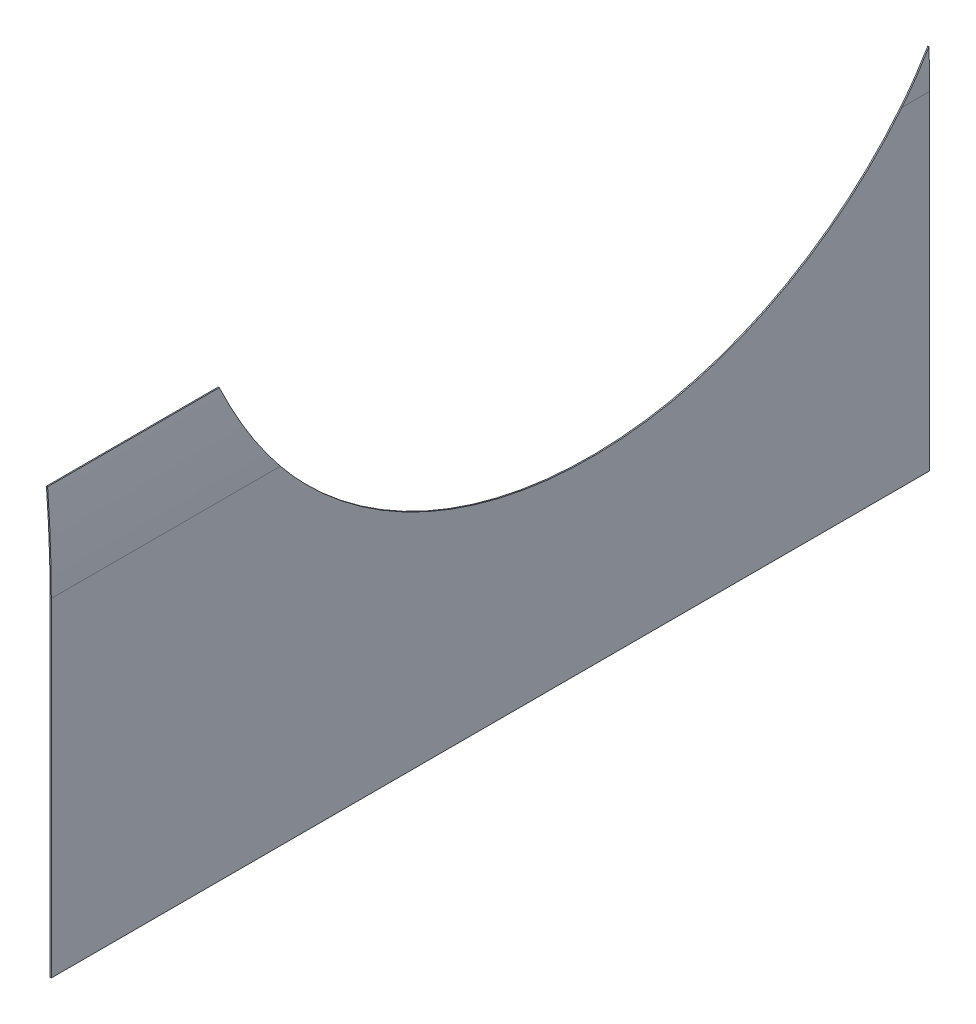
ISO-10303-21;
HEADER;
FILE_DESCRIPTION(('STEP AP214'),'2;1');
FILE_NAME('part.step','',(''),(''),'','','');
FILE_SCHEMA(('AUTOMOTIVE_DESIGN { 1 0 10303 214 1 1 1 1 }'));
ENDSEC;
DATA;
#1=APPLICATION_CONTEXT('core data for automotive mechanical design processes');
#2=APPLICATION_PROTOCOL_DEFINITION('international standard','automotive_design',2000,#1);
#3=PRODUCT_CONTEXT('',#1,'mechanical');
#4=PRODUCT('Part','Part','',(#3));
#5=PRODUCT_RELATED_PRODUCT_CATEGORY('part','',(#4));
#6=PRODUCT_DEFINITION_FORMATION('','',#4);
#7=PRODUCT_DEFINITION_CONTEXT('part definition',#1,'design');
#8=PRODUCT_DEFINITION('design','',#6,#7);
#9=PRODUCT_DEFINITION_SHAPE('','',#8);
#10=(LENGTH_UNIT() NAMED_UNIT(*) SI_UNIT(.MILLI.,.METRE.));
#11=(NAMED_UNIT(*) PLANE_ANGLE_UNIT() SI_UNIT($,.RADIAN.));
#12=(NAMED_UNIT(*) SI_UNIT($,.STERADIAN.) SOLID_ANGLE_UNIT());
#13=UNCERTAINTY_MEASURE_WITH_UNIT(LENGTH_MEASURE(1.E-05),#10,'distance_accuracy_value','');
#14=(GEOMETRIC_REPRESENTATION_CONTEXT(3) GLOBAL_UNCERTAINTY_ASSIGNED_CONTEXT((#13)) GLOBAL_UNIT_ASSIGNED_CONTEXT((#10,
#11,#12)) REPRESENTATION_CONTEXT('',''));
#15=CARTESIAN_POINT('',(0.,0.,0.));
#16=DIRECTION('',(0.,0.,1.));
#17=DIRECTION('',(1.,0.,0.));
#18=AXIS2_PLACEMENT_3D('',#15,#16,#17);
#19=CARTESIAN_POINT('',(-5.00000000000243,429.413496662776,1500.));
#20=DIRECTION('',(0.,0.,1.));
#21=DIRECTION('',(1.,0.,0.));
#22=AXIS2_PLACEMENT_3D('',#19,#20,#21);
#23=PLANE('',#22);
#24=CARTESIAN_POINT('',(-2100.,429.413496662785,1500.));
#25=DIRECTION('',(0.,0.,-1.));
#26=DIRECTION('',(1.,0.,0.));
#27=AXIS2_PLACEMENT_3D('',#24,#25,#26);
#28=CIRCLE('',#27,2095.);
#29=CARTESIAN_POINT('',(-11.2854840550565,591.57597962623,1500.));
#30=VERTEX_POINT('',#29);
#31=CARTESIAN_POINT('',(-5.00000000000243,429.413496662776,1500.));
#32=VERTEX_POINT('',#31);
#33=EDGE_CURVE('E99',#30,#32,#28,.T.);
#34=ORIENTED_EDGE('',*,*,#33,.F.);
#35=DIRECTION('',(0.996999768947468,0.0774045264741981,0.));
#36=VECTOR('',#35,1.);
#37=CARTESIAN_POINT('',(-11.2854840550565,591.57597962623,1500.));
#38=LINE('',#37,#36);
#39=CARTESIAN_POINT('',(-13.2794835929513,591.421170573282,1500.));
#40=VERTEX_POINT('',#39);
#41=EDGE_CURVE('E80',#30,#40,#38,.F.);
#42=ORIENTED_EDGE('',*,*,#41,.T.);
#43=CARTESIAN_POINT('',(-2100.,429.413496662785,1500.));
#44=DIRECTION('',(0.,0.,1.));
#45=DIRECTION('',(1.,0.,0.));
#46=AXIS2_PLACEMENT_3D('',#43,#44,#45);
#47=CIRCLE('',#46,2093.);
#48=CARTESIAN_POINT('',(-7.00000000000243,429.413496662776,1500.));
#49=VERTEX_POINT('',#48);
#50=EDGE_CURVE('E91',#40,#49,#47,.F.);
#51=ORIENTED_EDGE('',*,*,#50,.T.);
#52=DIRECTION('',(-1.,0.,0.));
#53=VECTOR('',#52,1.);
#54=CARTESIAN_POINT('',(-5.00000000000243,429.413496662776,1500.));
#55=LINE('',#54,#53);
#56=EDGE_CURVE('E106',#32,#49,#55,.T.);
#57=ORIENTED_EDGE('',*,*,#56,.F.);
#58=EDGE_LOOP('',(#34,#42,#51,#57));
#59=FACE_BOUND('',#58,.T.);
#60=ADVANCED_FACE('F37',(#59),#23,.T.);
#61=CARTESIAN_POINT('',(-19.1797937076434,672.749209383758,0.));
#62=DIRECTION('',(0.,0.,-1.));
#63=DIRECTION('',(-1.,0.,0.));
#64=AXIS2_PLACEMENT_3D('',#61,#62,#63);
#65=PLANE('',#64);
#66=CARTESIAN_POINT('',(-2100.,429.413496662785,0.));
#67=DIRECTION('',(0.,0.,1.));
#68=DIRECTION('',(1.,0.,0.));
#69=AXIS2_PLACEMENT_3D('',#66,#67,#68);
#70=CIRCLE('',#69,2093.);
#71=CARTESIAN_POINT('',(-8.02976236904085,495.060468156216,0.));
#72=VERTEX_POINT('',#71);
#73=CARTESIAN_POINT('',(-7.00000000000243,429.413496662776,0.));
#74=VERTEX_POINT('',#73);
#75=EDGE_CURVE('E218',#72,#74,#70,.F.);
#76=ORIENTED_EDGE('',*,*,#75,.F.);
#77=DIRECTION('',(0.999507996956981,0.0313650126581042,0.));
#78=VECTOR('',#77,1.);
#79=CARTESIAN_POINT('',(-8.02976236904129,495.060468156216,0.));
#80=LINE('',#79,#78);
#81=CARTESIAN_POINT('',(-6.03074637512721,495.123198181534,0.));
#82=VERTEX_POINT('',#81);
#83=EDGE_CURVE('E47',#82,#72,#80,.F.);
#84=ORIENTED_EDGE('',*,*,#83,.F.);
#85=CARTESIAN_POINT('',(-2100.,429.413496662785,0.));
#86=DIRECTION('',(0.,0.,-1.));
#87=DIRECTION('',(1.,0.,0.));
#88=AXIS2_PLACEMENT_3D('',#85,#86,#87);
#89=CIRCLE('',#88,2095.);
#90=CARTESIAN_POINT('',(-5.00000000000243,429.413496662776,0.));
#91=VERTEX_POINT('',#90);
#92=EDGE_CURVE('E206',#82,#91,#89,.T.);
#93=ORIENTED_EDGE('',*,*,#92,.T.);
#94=DIRECTION('',(1.,0.,0.));
#95=VECTOR('',#94,1.);
#96=CARTESIAN_POINT('',(-7.00000000000243,429.413496662776,0.));
#97=LINE('',#96,#95);
#98=EDGE_CURVE('E222',#74,#91,#97,.T.);
#99=ORIENTED_EDGE('',*,*,#98,.F.);
#100=EDGE_LOOP('',(#76,#84,#93,#99));
#101=FACE_BOUND('',#100,.T.);
#102=ADVANCED_FACE('F258',(#101),#65,.T.);
#103=CARTESIAN_POINT('',(-7.00000000000243,429.413496662776,1500.));
#104=DIRECTION('',(1.,0.,0.));
#105=DIRECTION('',(0.,1.,0.));
#106=AXIS2_PLACEMENT_3D('',#103,#104,#105);
#107=PLANE('',#106);
#108=CARTESIAN_POINT('',(-7.00000000000245,860.779048097804,578.000000000015));
#109=DIRECTION('',(-1.,0.,0.));
#110=DIRECTION('',(0.,3.69749714926331E-13,-1.));
#111=AXIS2_PLACEMENT_3D('',#108,#109,#110);
#112=ELLIPSE('',#111,684.,683.826642787176);
#113=CARTESIAN_POINT('',(-7.00000000000243,429.413496662776,47.2595695376983));
#114=VERTEX_POINT('',#113);
#115=CARTESIAN_POINT('',(-7.00000000000243,429.413496662776,1108.74043046233));
#116=VERTEX_POINT('',#115);
#117=EDGE_CURVE('E104',#114,#116,#112,.T.);
#118=ORIENTED_EDGE('',*,*,#117,.F.);
#119=DIRECTION('',(0.,0.,-1.));
#120=VECTOR('',#119,1.);
#121=CARTESIAN_POINT('',(-7.00000000000243,429.413496662776,1500.));
#122=LINE('',#121,#120);
#123=EDGE_CURVE('E203',#114,#74,#122,.T.);
#124=ORIENTED_EDGE('',*,*,#123,.T.);
#125=DIRECTION('',(0.,-1.,0.));
#126=VECTOR('',#125,1.);
#127=CARTESIAN_POINT('',(-7.00000000000243,429.413496662776,0.));
#128=LINE('',#127,#126);
#129=CARTESIAN_POINT('',(-7.00000000000481,-131.926503337224,0.));
#130=VERTEX_POINT('',#129);
#131=EDGE_CURVE('E201',#74,#130,#128,.T.);
#132=ORIENTED_EDGE('',*,*,#131,.T.);
#133=DIRECTION('',(0.,0.,-1.));
#134=VECTOR('',#133,1.);
#135=CARTESIAN_POINT('',(-7.00000000000481,-131.926503337224,1500.));
#136=LINE('',#135,#134);
#137=CARTESIAN_POINT('',(-7.00000000000481,-131.926503337224,1500.));
#138=VERTEX_POINT('',#137);
#139=EDGE_CURVE('E125',#138,#130,#136,.T.);
#140=ORIENTED_EDGE('',*,*,#139,.F.);
#141=DIRECTION('',(0.,-1.,0.));
#142=VECTOR('',#141,1.);
#143=CARTESIAN_POINT('',(-7.00000000000243,429.413496662776,1500.));
#144=LINE('',#143,#142);
#145=EDGE_CURVE('E126',#49,#138,#144,.T.);
#146=ORIENTED_EDGE('',*,*,#145,.F.);
#147=EDGE_CURVE('E197',#49,#116,#122,.T.);
#148=ORIENTED_EDGE('',*,*,#147,.T.);
#149=EDGE_LOOP('',(#118,#124,#132,#140,#146,#148));
#150=FACE_BOUND('',#149,.T.);
#151=ADVANCED_FACE('F199',(#150),#107,.F.);
#152=CARTESIAN_POINT('',(-5.00000000000243,429.413496662776,1500.));
#153=DIRECTION('',(1.,0.,0.));
#154=DIRECTION('',(0.,1.,0.));
#155=AXIS2_PLACEMENT_3D('',#152,#153,#154);
#156=PLANE('',#155);
#157=DIRECTION('',(0.,0.,-1.));
#158=VECTOR('',#157,1.);
#159=CARTESIAN_POINT('',(-5.00000000000243,429.413496662776,1500.));
#160=LINE('',#159,#158);
#161=CARTESIAN_POINT('',(-5.00000000000247,429.413496662776,47.2595695376983));
#162=VERTEX_POINT('',#161);
#163=EDGE_CURVE('E112',#162,#91,#160,.T.);
#164=ORIENTED_EDGE('',*,*,#163,.F.);
#165=CARTESIAN_POINT('',(-5.00000000000245,860.779048097804,578.000000000015));
#166=DIRECTION('',(-1.,0.,0.));
#167=DIRECTION('',(0.,3.69749714926331E-13,-1.));
#168=AXIS2_PLACEMENT_3D('',#165,#166,#167);
#169=ELLIPSE('',#168,684.,683.826642787176);
#170=CARTESIAN_POINT('',(-5.00000000000243,429.413496662776,1108.74043046233));
#171=VERTEX_POINT('',#170);
#172=EDGE_CURVE('E121',#162,#171,#169,.T.);
#173=ORIENTED_EDGE('',*,*,#172,.T.);
#174=EDGE_CURVE('E108',#32,#171,#160,.T.);
#175=ORIENTED_EDGE('',*,*,#174,.F.);
#176=DIRECTION('',(0.,-1.,0.));
#177=VECTOR('',#176,1.);
#178=CARTESIAN_POINT('',(-5.00000000000243,429.413496662776,1500.));
#179=LINE('',#178,#177);
#180=CARTESIAN_POINT('',(-5.00000000000481,-131.926503337224,1500.));
#181=VERTEX_POINT('',#180);
#182=EDGE_CURVE('E118',#32,#181,#179,.T.);
#183=ORIENTED_EDGE('',*,*,#182,.T.);
#184=DIRECTION('',(0.,0.,-1.));
#185=VECTOR('',#184,1.);
#186=CARTESIAN_POINT('',(-5.00000000000481,-131.926503337224,1500.));
#187=LINE('',#186,#185);
#188=CARTESIAN_POINT('',(-5.00000000000481,-131.926503337224,0.));
#189=VERTEX_POINT('',#188);
#190=EDGE_CURVE('E113',#181,#189,#187,.T.);
#191=ORIENTED_EDGE('',*,*,#190,.T.);
#192=DIRECTION('',(0.,-1.,0.));
#193=VECTOR('',#192,1.);
#194=CARTESIAN_POINT('',(-5.00000000000243,429.413496662776,0.));
#195=LINE('',#194,#193);
#196=EDGE_CURVE('E219',#91,#189,#195,.T.);
#197=ORIENTED_EDGE('',*,*,#196,.F.);
#198=EDGE_LOOP('',(#164,#173,#175,#183,#191,#197));
#199=FACE_BOUND('',#198,.T.);
#200=ADVANCED_FACE('F259',(#199),#156,.T.);
#201=CARTESIAN_POINT('',(-2100.,429.413496662785,1500.));
#202=DIRECTION('',(0.,0.,-1.));
#203=DIRECTION('',(-1.,0.,0.));
#204=AXIS2_PLACEMENT_3D('',#201,#202,#203);
#205=CYLINDRICAL_SURFACE('',#204,2095.);
#206=CARTESIAN_POINT('',(-5.00000000000256,429.413496662776,1108.74043046233));
#207=CARTESIAN_POINT('',(-4.99999978761936,430.45833681574,1109.59006964726));
#208=CARTESIAN_POINT('',(-5.0007815044143,431.505699537966,1110.43663613832));
#209=CARTESIAN_POINT('',(-5.00865552950862,436.755295376475,1114.65423575737));
#210=CARTESIAN_POINT('',(-5.0276446028735,440.995021906309,1117.97887372318));
#211=CARTESIAN_POINT('',(-5.07622522521046,447.412240053292,1122.8896023563));
#212=CARTESIAN_POINT('',(-5.09576746280954,449.560858239573,1124.51376401992));
#213=CARTESIAN_POINT('',(-5.16470899173735,456.035581045902,1129.34818076761));
#214=CARTESIAN_POINT('',(-5.22442208478793,460.390320908802,1132.5201848956));
#215=CARTESIAN_POINT('',(-5.33563541305948,466.977081730637,1137.19999036183));
#216=CARTESIAN_POINT('',(-5.37631239052545,469.181715917412,1138.74685068075));
#217=CARTESIAN_POINT('',(-5.50942569520375,475.823005744255,1143.34836965837));
#218=CARTESIAN_POINT('',(-5.61294111948025,480.286807705952,1146.36379083264));
#219=CARTESIAN_POINT('',(-5.79133968960746,487.034244361298,1150.80661567689));
#220=CARTESIAN_POINT('',(-5.85465805359061,489.291949223015,1152.27413344193));
#221=CARTESIAN_POINT('',(-6.05643011701042,496.090978620703,1156.63658364256));
#222=CARTESIAN_POINT('',(-6.206695055354,500.657969557135,1159.49124517684));
#223=CARTESIAN_POINT('',(-6.45661833901241,507.55699324892,1163.69118425455));
#224=CARTESIAN_POINT('',(-6.54401097637696,509.864692543967,1165.07745101889));
#225=CARTESIAN_POINT('',(-6.81869809302292,516.812121960602,1169.19525454439));
#226=CARTESIAN_POINT('',(-7.01849338749326,521.475927807221,1171.88563464191));
#227=CARTESIAN_POINT('',(-7.34402955661156,528.51703492893,1175.83726326532));
#228=CARTESIAN_POINT('',(-7.45684530626662,530.871570641819,1177.14044733202));
#229=CARTESIAN_POINT('',(-7.80845085965427,537.957918979301,1181.0080845141));
#230=CARTESIAN_POINT('',(-8.06038775338627,542.712210410164,1183.53047125066));
#231=CARTESIAN_POINT('',(-8.46534867834962,549.885650376717,1187.22862957478));
#232=CARTESIAN_POINT('',(-8.60484061608802,552.283729502489,1188.44707900279));
#233=CARTESIAN_POINT('',(-9.03707004682449,559.499020188482,1192.0597360447));
#234=CARTESIAN_POINT('',(-9.34354692889318,564.337016078042,1194.41110970906));
#235=CARTESIAN_POINT('',(-9.8314343639092,571.632723888217,1197.85112747235));
#236=CARTESIAN_POINT('',(-9.99875374164619,574.071009465796,1198.98326221687));
#237=CARTESIAN_POINT('',(-10.5223673627256,581.509811439739,1202.38402673674));
#238=CARTESIAN_POINT('',(-10.893752452512,586.530378618562,1204.60649255486));
#239=CARTESIAN_POINT('',(-11.2854840550565,591.57597962623,1206.76781033429));
#240=B_SPLINE_CURVE_WITH_KNOTS('',3,(#206,#207,#208,#209,#210,#211,#212,#213,#214,#215,#216,
#217,#218,#219,#220,#221,#222,#223,#224,#225,#226,#227,#228,#229,#230,#231,#232,#233,#234,#235,
#236,#237,#238,#239),.UNSPECIFIED.,.F.,.F.,(4,2,2,2,2,2,2,2,2,2,2,2,2,2,2,2,4),(0.,
4.04011747700291,20.2016889042895,28.282034846242,44.4436148293885,52.523961285784,
68.6855483094146,76.7658961590218,92.9274911498304,101.007839472787,117.169441260396,
125.249790865018,141.411399237832,149.49174916307,165.653363264909,173.733714270357,
190.241453364954),.UNSPECIFIED.);
#241=CARTESIAN_POINT('',(-11.2854840550565,591.57597962623,1206.76781033429));
#242=VERTEX_POINT('',#241);
#243=EDGE_CURVE('E102',#171,#242,#240,.T.);
#244=ORIENTED_EDGE('',*,*,#243,.T.);
#245=DIRECTION('',(0.,0.,-1.));
#246=VECTOR('',#245,1.);
#247=CARTESIAN_POINT('',(-11.2854840550565,591.57597962623,1500.));
#248=LINE('',#247,#246);
#249=EDGE_CURVE('E84',#30,#242,#248,.T.);
#250=ORIENTED_EDGE('',*,*,#249,.F.);
#251=ORIENTED_EDGE('',*,*,#33,.T.);
#252=ORIENTED_EDGE('',*,*,#174,.T.);
#253=EDGE_LOOP('',(#244,#250,#251,#252));
#254=FACE_BOUND('',#253,.T.);
#255=ADVANCED_FACE('F96',(#254),#205,.T.);
#256=ORIENTED_EDGE('',*,*,#92,.F.);
#257=CARTESIAN_POINT('',(-6.03074637512741,495.123198181535,0.));
#258=CARTESIAN_POINT('',(-5.99505075601267,493.985696085555,0.719972348805456));
#259=CARTESIAN_POINT('',(-5.96034887065867,492.85028251693,1.44332632984747));
#260=CARTESIAN_POINT('',(-5.79174930176199,487.183475088945,5.07712650632231));
#261=CARTESIAN_POINT('',(-5.67261141201959,482.683809566637,8.03806667092087));
#262=CARTESIAN_POINT('',(-5.51657299433865,475.987733252364,12.558659527959));
#263=CARTESIAN_POINT('',(-5.46833928182733,473.764672418488,14.0786776406254));
#264=CARTESIAN_POINT('',(-5.37925779408501,469.336546357748,17.1449654605254));
#265=CARTESIAN_POINT('',(-5.33841001847321,467.131481129955,18.6912351664053));
#266=CARTESIAN_POINT('',(-5.2639336608279,462.739704179149,21.8097471726674));
#267=CARTESIAN_POINT('',(-5.23030507833594,460.552992454969,23.3819894714001));
#268=CARTESIAN_POINT('',(-5.1399895947965,454.020511751235,28.137607011388));
#269=CARTESIAN_POINT('',(-5.09387780387027,449.702640040815,31.3597047671352));
#270=CARTESIAN_POINT('',(-5.04482500678246,443.284081554384,36.2685943716981));
#271=CARTESIAN_POINT('',(-5.03182663673338,441.154327904384,37.9174684313798));
#272=CARTESIAN_POINT('',(-5.00725854876372,435.804515998681,42.1101323128553));
#273=CARTESIAN_POINT('',(-4.99999985141022,432.597414403549,44.6704837546357));
#274=CARTESIAN_POINT('',(-5.0000000000025,429.413496662776,47.2595695376984));
#275=B_SPLINE_CURVE_WITH_KNOTS('',3,(#257,#258,#259,#260,#261,#262,#263,#264,#265,#266,#267,
#268,#269,#270,#271,#272,#273,#274),.UNSPECIFIED.,.F.,.F.,(4,2,2,2,2,2,2,2,4),(0.,
4.04007871766236,20.2015134393477,28.2817824026372,36.3620509493066,44.4423189828511,
60.6037409374541,68.6840082952298,80.9947730680957),.UNSPECIFIED.);
#276=EDGE_CURVE('E110',#82,#162,#275,.T.);
#277=ORIENTED_EDGE('',*,*,#276,.T.);
#278=ORIENTED_EDGE('',*,*,#163,.T.);
#279=EDGE_LOOP('',(#256,#277,#278));
#280=FACE_BOUND('',#279,.T.);
#281=ADVANCED_FACE('F249',(#280),#205,.T.);
#282=CARTESIAN_POINT('',(-2100.,429.413496662785,1500.));
#283=DIRECTION('',(0.,0.,-1.));
#284=DIRECTION('',(-1.,0.,0.));
#285=AXIS2_PLACEMENT_3D('',#282,#283,#284);
#286=CYLINDRICAL_SURFACE('',#285,2093.);
#287=DIRECTION('',(0.,0.,-1.));
#288=VECTOR('',#287,1.);
#289=CARTESIAN_POINT('',(-13.2794835929513,591.421170573282,1500.));
#290=LINE('',#289,#288);
#291=CARTESIAN_POINT('',(-13.2794835929513,591.421170573282,1206.76781033429));
#292=VERTEX_POINT('',#291);
#293=EDGE_CURVE('E41',#40,#292,#290,.T.);
#294=ORIENTED_EDGE('',*,*,#293,.T.);
#295=CARTESIAN_POINT('',(-7.00000000000256,429.413496662776,1108.74043046233));
#296=CARTESIAN_POINT('',(-6.99999985969334,430.44760302409,1109.58214399898));
#297=CARTESIAN_POINT('',(-7.00076630835743,431.484180058641,1110.42084060187));
#298=CARTESIAN_POINT('',(-7.00848595453242,436.679596794395,1114.59937459555));
#299=CARTESIAN_POINT('',(-7.02710178564623,440.875202046059,1117.89368735056));
#300=CARTESIAN_POINT('',(-7.09064106948509,449.348118377329,1124.38740993192));
#301=CARTESIAN_POINT('',(-7.1356007282682,453.625534052561,1127.58668276808));
#302=CARTESIAN_POINT('',(-7.25321203069024,462.253972299224,1133.88386444442));
#303=CARTESIAN_POINT('',(-7.32586359078731,466.60499464856,1136.98177359037));
#304=CARTESIAN_POINT('',(-7.50018999133705,475.378707520268,1143.07499327675));
#305=CARTESIAN_POINT('',(-7.60186929667882,479.80140896914,1146.07028795415));
#306=CARTESIAN_POINT('',(-7.83552881291014,488.715286973243,1151.95583730166));
#307=CARTESIAN_POINT('',(-7.96750847807716,493.20646229387,1154.84609386246));
#308=CARTESIAN_POINT('',(-8.23703252933645,501.459369491891,1160.02134026731));
#309=CARTESIAN_POINT('',(-8.36952137281406,505.210561874938,1162.32342382766));
#310=CARTESIAN_POINT('',(-8.65658679980899,512.756056593136,1166.85435460551));
#311=CARTESIAN_POINT('',(-8.81116322381158,516.55035861677,1169.08320235177));
#312=CARTESIAN_POINT('',(-9.14303620530192,524.180240851642,1173.46648536438));
#313=CARTESIAN_POINT('',(-9.32033048221485,528.015816884154,1175.62092807248));
#314=CARTESIAN_POINT('',(-9.69826241197383,535.726948004981,1179.85474044226));
#315=CARTESIAN_POINT('',(-9.8989001193935,539.602503186741,1181.93410992841));
#316=CARTESIAN_POINT('',(-10.539493249033,551.337322239681,1188.08512606416));
#317=CARTESIAN_POINT('',(-11.016012412547,559.255642752436,1192.04147170651));
#318=CARTESIAN_POINT('',(-11.8069082315298,571.239623596157,1197.74084044731));
#319=CARTESIAN_POINT('',(-12.0832528865515,575.252377058091,1199.60158552565));
#320=CARTESIAN_POINT('',(-12.6618260932808,583.311741924023,1203.24407334128));
#321=CARTESIAN_POINT('',(-12.9640547012028,587.358353401537,1205.02581590699));
#322=CARTESIAN_POINT('',(-13.2794835929514,591.421170573282,1206.76781033429));
#323=B_SPLINE_CURVE_WITH_KNOTS('',3,(#295,#296,#297,#298,#299,#300,#301,#302,#303,#304,#305,
#306,#307,#308,#309,#310,#311,#312,#313,#314,#315,#316,#317,#318,#319,#320,#321,#322),
.UNSPECIFIED.,.F.,.F.,(4,2,2,2,2,2,2,2,2,2,2,2,2,4),(0.,4.00011598392286,20.0016506782762,
36.0252290912806,52.0487591641937,68.0747552180614,84.1004626594853,97.3093600015348,
110.518161954798,123.725638954692,136.933146832411,163.518035534377,176.812724192444,
190.107441724355),.UNSPECIFIED.);
#324=EDGE_CURVE('E135',#116,#292,#323,.T.);
#325=ORIENTED_EDGE('',*,*,#324,.F.);
#326=ORIENTED_EDGE('',*,*,#147,.F.);
#327=ORIENTED_EDGE('',*,*,#50,.F.);
#328=EDGE_LOOP('',(#294,#325,#326,#327));
#329=FACE_BOUND('',#328,.T.);
#330=ADVANCED_FACE('F195',(#329),#286,.F.);
#331=CARTESIAN_POINT('',(-8.02976236904137,495.060468156219,0.));
#332=CARTESIAN_POINT('',(-7.99442976584127,493.934532756679,0.713332847973603));
#333=CARTESIAN_POINT('',(-7.96007187765686,492.810652417993,1.42998023136508));
#334=CARTESIAN_POINT('',(-7.79309860714821,487.201338997084,5.02991612929789));
#335=CARTESIAN_POINT('',(-7.6749611149618,482.747091596325,7.96272069208497));
#336=CARTESIAN_POINT('',(-7.47338435211407,474.124157406676,13.7863003239828));
#337=CARTESIAN_POINT('',(-7.38853141751405,469.952153938625,16.672123895483));
#338=CARTESIAN_POINT('',(-7.24452795578729,461.673000827063,22.5362416917324));
#339=CARTESIAN_POINT('',(-7.18537819455732,457.565853119623,25.5145386691482));
#340=CARTESIAN_POINT('',(-7.09154583192697,449.410193512617,31.5683570306458));
#341=CARTESIAN_POINT('',(-7.05691459923242,445.361822022486,34.6440685149463));
#342=CARTESIAN_POINT('',(-7.02258491966116,439.341610081444,39.3248061052085));
#343=CARTESIAN_POINT('',(-7.01407788577619,437.343611859447,40.8962349206129));
#344=CARTESIAN_POINT('',(-7.00278540035768,433.365264612458,44.0612970165018));
#345=CARTESIAN_POINT('',(-6.9999999482905,431.38491558582,45.6549302949153));
#346=CARTESIAN_POINT('',(-7.0000000000025,429.413496662776,47.2595695376984));
#347=B_SPLINE_CURVE_WITH_KNOTS('',3,(#331,#332,#333,#334,#335,#336,#337,#338,#339,#340,#341,
#342,#343,#344,#345,#346),.UNSPECIFIED.,.F.,.F.,(4,2,2,2,2,2,2,4),(0.,4.00007761211791,
20.0014772056602,35.220814516663,50.4406052986014,65.6921894130867,73.3178664108622,
80.9435426974224),.UNSPECIFIED.);
#348=EDGE_CURVE('E11',#72,#114,#347,.T.);
#349=ORIENTED_EDGE('',*,*,#348,.F.);
#350=ORIENTED_EDGE('',*,*,#75,.T.);
#351=ORIENTED_EDGE('',*,*,#123,.F.);
#352=EDGE_LOOP('',(#349,#350,#351));
#353=FACE_BOUND('',#352,.T.);
#354=ADVANCED_FACE('F257',(#353),#286,.F.);
#355=CARTESIAN_POINT('',(-21.1662569117408,672.516907987365,1500.));
#356=DIRECTION('',(0.,0.,1.));
#357=DIRECTION('',(1.,0.,0.));
#358=AXIS2_PLACEMENT_3D('',#355,#356,#357);
#359=PLANE('',#358);
#360=ORIENTED_EDGE('',*,*,#182,.F.);
#361=ORIENTED_EDGE('',*,*,#56,.T.);
#362=ORIENTED_EDGE('',*,*,#145,.T.);
#363=DIRECTION('',(-1.,0.,0.));
#364=VECTOR('',#363,1.);
#365=CARTESIAN_POINT('',(-5.00000000000481,-131.926503337224,1500.));
#366=LINE('',#365,#364);
#367=EDGE_CURVE('E122',#181,#138,#366,.T.);
#368=ORIENTED_EDGE('',*,*,#367,.F.);
#369=EDGE_LOOP('',(#360,#361,#362,#368));
#370=FACE_BOUND('',#369,.T.);
#371=ADVANCED_FACE('F276',(#370),#359,.T.);
#372=CARTESIAN_POINT('',(-5.00000000000481,-131.926503337224,1500.));
#373=DIRECTION('',(0.,-1.,0.));
#374=DIRECTION('',(0.,0.,-1.));
#375=AXIS2_PLACEMENT_3D('',#372,#373,#374);
#376=PLANE('',#375);
#377=DIRECTION('',(-1.,0.,0.));
#378=VECTOR('',#377,1.);
#379=CARTESIAN_POINT('',(-5.00000000000481,-131.926503337224,0.));
#380=LINE('',#379,#378);
#381=EDGE_CURVE('E131',#189,#130,#380,.T.);
#382=ORIENTED_EDGE('',*,*,#381,.F.);
#383=ORIENTED_EDGE('',*,*,#190,.F.);
#384=ORIENTED_EDGE('',*,*,#367,.T.);
#385=ORIENTED_EDGE('',*,*,#139,.T.);
#386=EDGE_LOOP('',(#382,#383,#384,#385));
#387=FACE_BOUND('',#386,.T.);
#388=ADVANCED_FACE('F234',(#387),#376,.T.);
#389=CARTESIAN_POINT('',(-2100.,429.413496662785,0.));
#390=DIRECTION('',(0.,0.,-1.));
#391=DIRECTION('',(-1.,0.,0.));
#392=AXIS2_PLACEMENT_3D('',#389,#390,#391);
#393=PLANE('',#392);
#394=ORIENTED_EDGE('',*,*,#131,.F.);
#395=ORIENTED_EDGE('',*,*,#98,.T.);
#396=ORIENTED_EDGE('',*,*,#196,.T.);
#397=ORIENTED_EDGE('',*,*,#381,.T.);
#398=EDGE_LOOP('',(#394,#395,#396,#397));
#399=FACE_BOUND('',#398,.T.);
#400=ADVANCED_FACE('F144',(#399),#393,.T.);
#401=CARTESIAN_POINT('',(-5.00000000000245,860.779048097804,578.000000000015));
#402=DIRECTION('',(-1.,0.,0.));
#403=DIRECTION('',(0.,3.69749714926331E-13,-1.));
#404=AXIS2_PLACEMENT_3D('',#401,#402,#403);
#405=ELLIPSE('',#404,684.,683.826642787176);
#406=DIRECTION('',(1.,0.,0.));
#407=VECTOR('',#406,1.);
#408=SURFACE_OF_LINEAR_EXTRUSION('',#405,#407);
#409=DIRECTION('',(1.,0.,0.));
#410=VECTOR('',#409,1.);
#411=CARTESIAN_POINT('',(-5.00000000000243,429.413496662776,1108.74043046233));
#412=LINE('',#411,#410);
#413=EDGE_CURVE('E132',#171,#116,#412,.F.);
#414=ORIENTED_EDGE('',*,*,#413,.F.);
#415=ORIENTED_EDGE('',*,*,#172,.F.);
#416=DIRECTION('',(1.,0.,0.));
#417=VECTOR('',#416,1.);
#418=CARTESIAN_POINT('',(-5.00000000000256,429.413496662776,47.2595695376983));
#419=LINE('',#418,#417);
#420=EDGE_CURVE('E129',#162,#114,#419,.F.);
#421=ORIENTED_EDGE('',*,*,#420,.T.);
#422=ORIENTED_EDGE('',*,*,#117,.T.);
#423=EDGE_LOOP('',(#414,#415,#421,#422));
#424=FACE_BOUND('',#423,.T.);
#425=ADVANCED_FACE('F140',(#424),#408,.T.);
#426=CARTESIAN_POINT('',(-11.2854840550565,591.57597962623,1353.38390516714));
#427=DIRECTION('',(0.0774045264741981,-0.996999768947468,0.));
#428=DIRECTION('',(0.,0.,-1.));
#429=AXIS2_PLACEMENT_3D('',#426,#427,#428);
#430=PLANE('',#429);
#431=ORIENTED_EDGE('',*,*,#41,.F.);
#432=ORIENTED_EDGE('',*,*,#249,.T.);
#433=DIRECTION('',(0.996999768947468,0.0774045264741981,0.));
#434=VECTOR('',#433,1.);
#435=CARTESIAN_POINT('',(-11.2854840550565,591.57597962623,1206.76781033429));
#436=LINE('',#435,#434);
#437=EDGE_CURVE('E103',#242,#292,#436,.F.);
#438=ORIENTED_EDGE('',*,*,#437,.T.);
#439=ORIENTED_EDGE('',*,*,#293,.F.);
#440=EDGE_LOOP('',(#431,#432,#438,#439));
#441=FACE_BOUND('',#440,.T.);
#442=ADVANCED_FACE('F82',(#441),#430,.F.);
#443=CARTESIAN_POINT('',(-7.02000000000256,429.413496662776,1108.74043046233));
#444=CARTESIAN_POINT('',(-7.02000000000251,441.785825600443,1118.81099605888));
#445=CARTESIAN_POINT('',(-7.1296803184442,454.44663950579,1128.3969762934));
#446=CARTESIAN_POINT('',(-7.5994027079738,480.330818828702,1146.62122223294));
#447=CARTESIAN_POINT('',(-7.95941826566833,493.554235655907,1155.25947599671));
#448=CARTESIAN_POINT('',(-8.96185061633993,520.557820918675,1171.59595941025));
#449=CARTESIAN_POINT('',(-9.60423761033838,534.337992114582,1179.29418640185));
#450=CARTESIAN_POINT('',(-11.2053768376153,562.457156453021,1193.74500823115));
#451=CARTESIAN_POINT('',(-12.1640957471093,576.796167667686,1200.49764762493));
#452=CARTESIAN_POINT('',(-13.2994235883304,591.419622482753,1206.76781033429));
#453=CARTESIAN_POINT('',(-7.00000000000256,429.413496662776,1108.74043046233));
#454=CARTESIAN_POINT('',(-7.0000000000025,441.785943829268,1118.81099606043));
#455=CARTESIAN_POINT('',(-7.10968136652224,454.446878716321,1128.3969762934));
#456=CARTESIAN_POINT('',(-7.57940824460299,480.331305382059,1146.62122223294));
#457=CARTESIAN_POINT('',(-7.93942724251728,493.554848568969,1155.25947599671));
#458=CARTESIAN_POINT('',(-8.94186917218487,520.558691871328,1171.59595941025));
#459=CARTESIAN_POINT('',(-9.58426230467479,534.338994747148,1179.29418640185));
#460=CARTESIAN_POINT('',(-11.1854168320427,562.458427785377,1193.74500823115));
#461=CARTESIAN_POINT('',(-12.1441449029451,576.797576021731,1200.49764762563));
#462=CARTESIAN_POINT('',(-13.2794835929514,591.421170573282,1206.76781033429));
#463=CARTESIAN_POINT('',(-5.00000000000256,429.413496662776,1108.74043046233));
#464=CARTESIAN_POINT('',(-5.0000000000025,441.797766711762,1118.81099621534));
#465=CARTESIAN_POINT('',(-5.10978617432589,454.470799769406,1128.3969762934));
#466=CARTESIAN_POINT('',(-5.57996190752186,480.379960717672,1146.62122223294));
#467=CARTESIAN_POINT('',(-5.94032492741218,493.616139875138,1155.25947599671));
#468=CARTESIAN_POINT('',(-6.94372475667811,520.645787136697,1171.59595941025));
#469=CARTESIAN_POINT('',(-7.58673173831518,534.439258003798,1179.29418640185));
#470=CARTESIAN_POINT('',(-9.18941627478716,562.585561021042,1193.74500823115));
#471=CARTESIAN_POINT('',(-10.1490604865228,576.938411426234,1200.49764769581));
#472=CARTESIAN_POINT('',(-11.2854840550565,591.57597962623,1206.76781033429));
#473=CARTESIAN_POINT('',(-4.97980000000256,429.413496662776,1108.74043046233));
#474=CARTESIAN_POINT('',(-4.97980000000251,441.797886122875,1118.81099621691));
#475=CARTESIAN_POINT('',(-5.08958723288471,454.471041372042,1128.3969762934));
#476=CARTESIAN_POINT('',(-5.55976749951734,480.380452136561,1146.62122223294));
#477=CARTESIAN_POINT('',(-5.92013399402962,493.61675891733,1155.25947599671));
#478=CARTESIAN_POINT('',(-6.92354349808149,520.646666798878,1171.59595941025));
#479=CARTESIAN_POINT('',(-7.56655667959495,534.440270662691,1179.29418640185));
#480=CARTESIAN_POINT('',(-9.16925666915888,562.586845066722,1193.74500823115));
#481=CARTESIAN_POINT('',(-10.1289101339169,576.939833863819,1200.49764769652));
#482=CARTESIAN_POINT('',(-11.2653446597237,591.577543197665,1206.76781033429));
#483=B_SPLINE_SURFACE_WITH_KNOTS('',1,3,((#443,#444,#445,#446,#447,#448,#449,#450,#451,#452),
(#453,#454,#455,#456,#457,#458,#459,#460,#461,#462),(#463,#464,#465,#466,#467,#468,#469,#470,
#471,#472),(#473,#474,#475,#476,#477,#478,#479,#480,#481,#482)),.UNSPECIFIED.,.F.,.F.,.F.,(2,1,
1,2),(4,2,2,2,4),(-0.01,0.,1.,1.0101),(0.,0.0473982762049691,0.0947965524099376,
0.142194828614906,0.189593104819875),.UNSPECIFIED.);
#484=ORIENTED_EDGE('',*,*,#437,.F.);
#485=ORIENTED_EDGE('',*,*,#243,.F.);
#486=ORIENTED_EDGE('',*,*,#413,.T.);
#487=ORIENTED_EDGE('',*,*,#324,.T.);
#488=EDGE_LOOP('',(#484,#485,#486,#487));
#489=FACE_BOUND('',#488,.T.);
#490=ADVANCED_FACE('F149',(#489),#483,.F.);
#491=CARTESIAN_POINT('',(-8.04975252898051,495.059840855966,0.));
#492=CARTESIAN_POINT('',(-7.6918408121326,483.654278004981,7.22604275588821));
#493=CARTESIAN_POINT('',(-7.43454793041532,472.481417089885,14.7781703090853));
#494=CARTESIAN_POINT('',(-7.09862036830224,450.599154567048,30.5313143442487));
#495=CARTESIAN_POINT('',(-7.02000000000246,439.889739526562,38.7323398223679));
#496=CARTESIAN_POINT('',(-7.0200000000025,429.413496662776,47.2595695376984));
#497=CARTESIAN_POINT('',(-8.02976236904137,495.060468156219,0.));
#498=CARTESIAN_POINT('',(-7.67184723210751,483.654796317449,7.22604275528259));
#499=CARTESIAN_POINT('',(-7.41455189173296,472.481828636297,14.7781703090853));
#500=CARTESIAN_POINT('',(-7.07862111957907,450.599357011963,30.5313143442487));
#501=CARTESIAN_POINT('',(-7.00000000000246,439.889839635903,38.7323398215943));
#502=CARTESIAN_POINT('',(-7.0000000000025,429.413496662776,47.2595695376984));
#503=CARTESIAN_POINT('',(-6.03074637512741,495.123198181535,0.));
#504=CARTESIAN_POINT('',(-5.67248922959849,483.706627564259,7.22604269472055));
#505=CARTESIAN_POINT('',(-5.41494802349764,472.522983277456,14.7781703090853));
#506=CARTESIAN_POINT('',(-5.07869624726141,450.619601503458,30.5313143442487));
#507=CARTESIAN_POINT('',(-5.00000000000246,439.899850569993,38.7323397442379));
#508=CARTESIAN_POINT('',(-5.0000000000025,429.413496662776,47.2595695376984));
#509=CARTESIAN_POINT('',(-6.01055631358887,495.123831754791,0.));
#510=CARTESIAN_POINT('',(-5.65229571377315,483.707151059852,7.22604269410888));
#511=CARTESIAN_POINT('',(-5.39475202442846,472.523398939332,14.7781703090853));
#512=CARTESIAN_POINT('',(-5.05849700605101,450.619805972822,30.5313143442487));
#513=CARTESIAN_POINT('',(-4.97980000000246,439.899951680428,38.7323397434566));
#514=CARTESIAN_POINT('',(-4.9798000000025,429.413496662776,47.2595695376984));
#515=B_SPLINE_SURFACE_WITH_KNOTS('',1,3,((#491,#492,#493,#494,#495,#496),(#497,#498,#499,#500,
#501,#502),(#503,#504,#505,#506,#507,#508),(#509,#510,#511,#512,#513,#514)),.UNSPECIFIED.,.F.,
.F.,.F.,(2,1,1,2),(4,2,4),(-0.01,0.,1.,1.0101),(0.,0.0404731214037889,0.0809462428075747),.UNSPECIFIED.);
#516=ORIENTED_EDGE('',*,*,#420,.F.);
#517=ORIENTED_EDGE('',*,*,#276,.F.);
#518=ORIENTED_EDGE('',*,*,#83,.T.);
#519=ORIENTED_EDGE('',*,*,#348,.T.);
#520=EDGE_LOOP('',(#516,#517,#518,#519));
#521=FACE_BOUND('',#520,.T.);
#522=ADVANCED_FACE('F155',(#521),#515,.F.);
#523=CLOSED_SHELL('',(#60,#102,#151,#200,#255,#281,#330,#354,#371,#388,#400,#425,#442,#490,#522));
#524=MANIFOLD_SOLID_BREP('B2',#523);
#525=ADVANCED_BREP_SHAPE_REPRESENTATION('',(#18,#524),#14);
#526=SHAPE_DEFINITION_REPRESENTATION(#9,#525);
ENDSEC;
END-ISO-10303-21;
